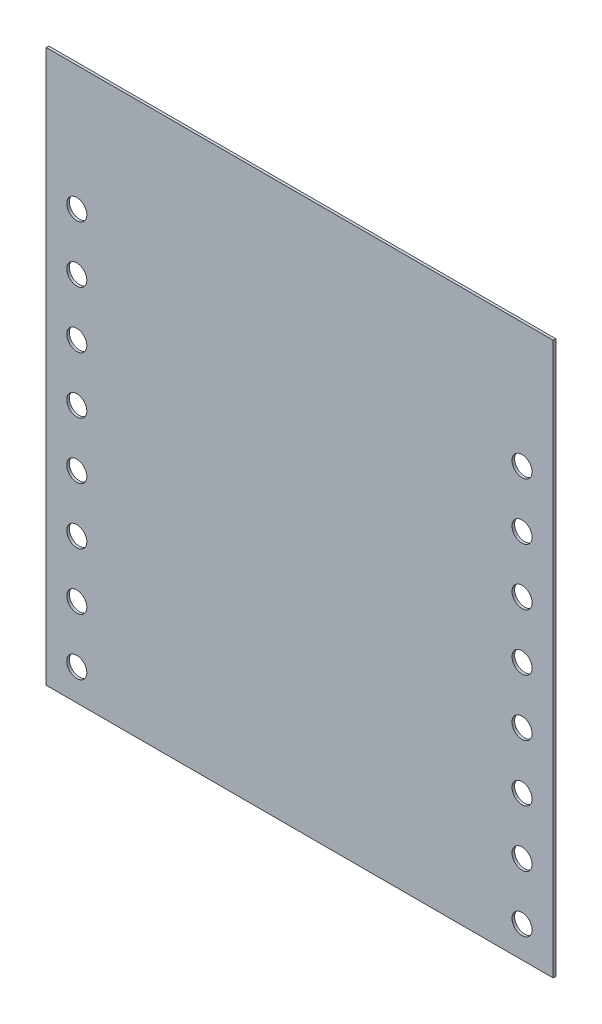
ISO-10303-21;
HEADER;
FILE_DESCRIPTION(('STEP AP214'),'2;1');
FILE_NAME('part.step','',(''),(''),'','','');
FILE_SCHEMA(('AUTOMOTIVE_DESIGN { 1 0 10303 214 1 1 1 1 }'));
ENDSEC;
DATA;
#1=APPLICATION_CONTEXT('core data for automotive mechanical design processes');
#2=APPLICATION_PROTOCOL_DEFINITION('international standard','automotive_design',2000,#1);
#3=PRODUCT_CONTEXT('',#1,'mechanical');
#4=PRODUCT('Part','Part','',(#3));
#5=PRODUCT_RELATED_PRODUCT_CATEGORY('part','',(#4));
#6=PRODUCT_DEFINITION_FORMATION('','',#4);
#7=PRODUCT_DEFINITION_CONTEXT('part definition',#1,'design');
#8=PRODUCT_DEFINITION('design','',#6,#7);
#9=PRODUCT_DEFINITION_SHAPE('','',#8);
#10=(LENGTH_UNIT() NAMED_UNIT(*) SI_UNIT(.MILLI.,.METRE.));
#11=(NAMED_UNIT(*) PLANE_ANGLE_UNIT() SI_UNIT($,.RADIAN.));
#12=(NAMED_UNIT(*) SI_UNIT($,.STERADIAN.) SOLID_ANGLE_UNIT());
#13=UNCERTAINTY_MEASURE_WITH_UNIT(LENGTH_MEASURE(1.E-05),#10,'distance_accuracy_value','');
#14=(GEOMETRIC_REPRESENTATION_CONTEXT(3) GLOBAL_UNCERTAINTY_ASSIGNED_CONTEXT((#13)) GLOBAL_UNIT_ASSIGNED_CONTEXT((#10,
#11,#12)) REPRESENTATION_CONTEXT('',''));
#15=CARTESIAN_POINT('',(0.,0.,0.));
#16=DIRECTION('',(0.,0.,1.));
#17=DIRECTION('',(1.,0.,0.));
#18=AXIS2_PLACEMENT_3D('',#15,#16,#17);
#19=CARTESIAN_POINT('',(0.,0.,0.11684));
#20=DIRECTION('',(0.,0.,-1.));
#21=DIRECTION('',(0.,-1.,0.));
#22=AXIS2_PLACEMENT_3D('',#19,#20,#21);
#23=PLANE('',#22);
#24=CARTESIAN_POINT('',(21.336,14.097,0.11684));
#25=DIRECTION('',(0.,0.,1.));
#26=DIRECTION('',(1.,0.,0.));
#27=AXIS2_PLACEMENT_3D('',#24,#25,#26);
#28=CIRCLE('',#27,0.4499991);
#29=CARTESIAN_POINT('',(21.7859991,14.097,0.11684));
#30=VERTEX_POINT('',#29);
#31=EDGE_CURVE('E26',#30,#30,#28,.T.);
#32=ORIENTED_EDGE('',*,*,#31,.F.);
#33=EDGE_LOOP('',(#32));
#34=FACE_BOUND('',#33,.T.);
#35=CARTESIAN_POINT('',(21.336,11.557,0.11684));
#36=DIRECTION('',(0.,0.,1.));
#37=DIRECTION('',(1.,0.,0.));
#38=AXIS2_PLACEMENT_3D('',#35,#36,#37);
#39=CIRCLE('',#38,0.4499991);
#40=CARTESIAN_POINT('',(21.7859991,11.557,0.11684));
#41=VERTEX_POINT('',#40);
#42=EDGE_CURVE('E354',#41,#41,#39,.T.);
#43=ORIENTED_EDGE('',*,*,#42,.F.);
#44=EDGE_LOOP('',(#43));
#45=FACE_BOUND('',#44,.T.);
#46=CARTESIAN_POINT('',(21.336,19.177,0.11684));
#47=DIRECTION('',(0.,0.,1.));
#48=DIRECTION('',(1.,0.,0.));
#49=AXIS2_PLACEMENT_3D('',#46,#47,#48);
#50=CIRCLE('',#49,0.4499991);
#51=CARTESIAN_POINT('',(21.7859991,19.177,0.11684));
#52=VERTEX_POINT('',#51);
#53=EDGE_CURVE('E252',#52,#52,#50,.T.);
#54=ORIENTED_EDGE('',*,*,#53,.F.);
#55=EDGE_LOOP('',(#54));
#56=FACE_BOUND('',#55,.T.);
#57=CARTESIAN_POINT('',(21.336,16.637,0.11684));
#58=DIRECTION('',(0.,0.,1.));
#59=DIRECTION('',(1.,0.,0.));
#60=AXIS2_PLACEMENT_3D('',#57,#58,#59);
#61=CIRCLE('',#60,0.4499991);
#62=CARTESIAN_POINT('',(21.7859991,16.637,0.11684));
#63=VERTEX_POINT('',#62);
#64=EDGE_CURVE('E392',#63,#63,#61,.T.);
#65=ORIENTED_EDGE('',*,*,#64,.F.);
#66=EDGE_LOOP('',(#65));
#67=FACE_BOUND('',#66,.T.);
#68=CARTESIAN_POINT('',(21.336,3.937,0.11684));
#69=DIRECTION('',(0.,0.,1.));
#70=DIRECTION('',(1.,0.,0.));
#71=AXIS2_PLACEMENT_3D('',#68,#69,#70);
#72=CIRCLE('',#71,0.4499991);
#73=CARTESIAN_POINT('',(21.7859991,3.937,0.11684));
#74=VERTEX_POINT('',#73);
#75=EDGE_CURVE('E382',#74,#74,#72,.T.);
#76=ORIENTED_EDGE('',*,*,#75,.F.);
#77=EDGE_LOOP('',(#76));
#78=FACE_BOUND('',#77,.T.);
#79=CARTESIAN_POINT('',(21.336,1.397,0.11684));
#80=DIRECTION('',(0.,0.,1.));
#81=DIRECTION('',(1.,0.,0.));
#82=AXIS2_PLACEMENT_3D('',#79,#80,#81);
#83=CIRCLE('',#82,0.4499991);
#84=CARTESIAN_POINT('',(21.7859991,1.397,0.11684));
#85=VERTEX_POINT('',#84);
#86=EDGE_CURVE('E347',#85,#85,#83,.T.);
#87=ORIENTED_EDGE('',*,*,#86,.F.);
#88=EDGE_LOOP('',(#87));
#89=FACE_BOUND('',#88,.T.);
#90=CARTESIAN_POINT('',(21.336,9.017,0.11684));
#91=DIRECTION('',(0.,0.,1.));
#92=DIRECTION('',(1.,0.,0.));
#93=AXIS2_PLACEMENT_3D('',#90,#91,#92);
#94=CIRCLE('',#93,0.4499991);
#95=CARTESIAN_POINT('',(21.7859991,9.017,0.11684));
#96=VERTEX_POINT('',#95);
#97=EDGE_CURVE('E321',#96,#96,#94,.T.);
#98=ORIENTED_EDGE('',*,*,#97,.F.);
#99=EDGE_LOOP('',(#98));
#100=FACE_BOUND('',#99,.T.);
#101=CARTESIAN_POINT('',(21.336,6.477,0.11684));
#102=DIRECTION('',(0.,0.,1.));
#103=DIRECTION('',(1.,0.,0.));
#104=AXIS2_PLACEMENT_3D('',#101,#102,#103);
#105=CIRCLE('',#104,0.4499991);
#106=CARTESIAN_POINT('',(21.7859991,6.477,0.11684));
#107=VERTEX_POINT('',#106);
#108=EDGE_CURVE('E364',#107,#107,#105,.T.);
#109=ORIENTED_EDGE('',*,*,#108,.F.);
#110=EDGE_LOOP('',(#109));
#111=FACE_BOUND('',#110,.T.);
#112=CARTESIAN_POINT('',(1.3716,14.097,0.11684));
#113=DIRECTION('',(0.,0.,1.));
#114=DIRECTION('',(1.,0.,0.));
#115=AXIS2_PLACEMENT_3D('',#112,#113,#114);
#116=CIRCLE('',#115,0.4499991);
#117=CARTESIAN_POINT('',(1.8215991,14.097,0.11684));
#118=VERTEX_POINT('',#117);
#119=EDGE_CURVE('E313',#118,#118,#116,.T.);
#120=ORIENTED_EDGE('',*,*,#119,.F.);
#121=EDGE_LOOP('',(#120));
#122=FACE_BOUND('',#121,.T.);
#123=CARTESIAN_POINT('',(1.3716,11.557,0.11684));
#124=DIRECTION('',(0.,0.,1.));
#125=DIRECTION('',(1.,0.,0.));
#126=AXIS2_PLACEMENT_3D('',#123,#124,#125);
#127=CIRCLE('',#126,0.4499991);
#128=CARTESIAN_POINT('',(1.8215991,11.557,0.11684));
#129=VERTEX_POINT('',#128);
#130=EDGE_CURVE('E265',#129,#129,#127,.T.);
#131=ORIENTED_EDGE('',*,*,#130,.F.);
#132=EDGE_LOOP('',(#131));
#133=FACE_BOUND('',#132,.T.);
#134=CARTESIAN_POINT('',(1.3716,19.177,0.11684));
#135=DIRECTION('',(0.,0.,1.));
#136=DIRECTION('',(1.,0.,0.));
#137=AXIS2_PLACEMENT_3D('',#134,#135,#136);
#138=CIRCLE('',#137,0.4499991);
#139=CARTESIAN_POINT('',(1.8215991,19.177,0.11684));
#140=VERTEX_POINT('',#139);
#141=EDGE_CURVE('E296',#140,#140,#138,.T.);
#142=ORIENTED_EDGE('',*,*,#141,.F.);
#143=EDGE_LOOP('',(#142));
#144=FACE_BOUND('',#143,.T.);
#145=CARTESIAN_POINT('',(1.3716,16.637,0.11684));
#146=DIRECTION('',(0.,0.,1.));
#147=DIRECTION('',(1.,0.,0.));
#148=AXIS2_PLACEMENT_3D('',#145,#146,#147);
#149=CIRCLE('',#148,0.4499991);
#150=CARTESIAN_POINT('',(1.8215991,16.637,0.11684));
#151=VERTEX_POINT('',#150);
#152=EDGE_CURVE('E328',#151,#151,#149,.T.);
#153=ORIENTED_EDGE('',*,*,#152,.F.);
#154=EDGE_LOOP('',(#153));
#155=FACE_BOUND('',#154,.T.);
#156=CARTESIAN_POINT('',(1.3716,3.937,0.11684));
#157=DIRECTION('',(0.,0.,1.));
#158=DIRECTION('',(1.,0.,0.));
#159=AXIS2_PLACEMENT_3D('',#156,#157,#158);
#160=CIRCLE('',#159,0.4499991);
#161=CARTESIAN_POINT('',(1.8215991,3.937,0.11684));
#162=VERTEX_POINT('',#161);
#163=EDGE_CURVE('E272',#162,#162,#160,.T.);
#164=ORIENTED_EDGE('',*,*,#163,.F.);
#165=EDGE_LOOP('',(#164));
#166=FACE_BOUND('',#165,.T.);
#167=CARTESIAN_POINT('',(1.3716,1.397,0.11684));
#168=DIRECTION('',(0.,0.,1.));
#169=DIRECTION('',(1.,0.,0.));
#170=AXIS2_PLACEMENT_3D('',#167,#168,#169);
#171=CIRCLE('',#170,0.4499991);
#172=CARTESIAN_POINT('',(1.8215991,1.397,0.11684));
#173=VERTEX_POINT('',#172);
#174=EDGE_CURVE('E303',#173,#173,#171,.T.);
#175=ORIENTED_EDGE('',*,*,#174,.F.);
#176=EDGE_LOOP('',(#175));
#177=FACE_BOUND('',#176,.T.);
#178=CARTESIAN_POINT('',(1.3716,9.017,0.11684));
#179=DIRECTION('',(0.,0.,1.));
#180=DIRECTION('',(1.,0.,0.));
#181=AXIS2_PLACEMENT_3D('',#178,#179,#180);
#182=CIRCLE('',#181,0.4499991);
#183=CARTESIAN_POINT('',(1.8215991,9.017,0.11684));
#184=VERTEX_POINT('',#183);
#185=EDGE_CURVE('E289',#184,#184,#182,.T.);
#186=ORIENTED_EDGE('',*,*,#185,.F.);
#187=EDGE_LOOP('',(#186));
#188=FACE_BOUND('',#187,.T.);
#189=CARTESIAN_POINT('',(1.3716,6.477,0.11684));
#190=DIRECTION('',(0.,0.,1.));
#191=DIRECTION('',(1.,0.,0.));
#192=AXIS2_PLACEMENT_3D('',#189,#190,#191);
#193=CIRCLE('',#192,0.4499991);
#194=CARTESIAN_POINT('',(1.8215991,6.477,0.11684));
#195=VERTEX_POINT('',#194);
#196=EDGE_CURVE('E256',#195,#195,#193,.T.);
#197=ORIENTED_EDGE('',*,*,#196,.F.);
#198=EDGE_LOOP('',(#197));
#199=FACE_BOUND('',#198,.T.);
#200=DIRECTION('',(1.,0.,0.));
#201=VECTOR('',#200,1.);
#202=CARTESIAN_POINT('',(0.,0.,0.11684));
#203=LINE('',#202,#201);
#204=CARTESIAN_POINT('',(0.,0.,0.11684));
#205=VERTEX_POINT('',#204);
#206=CARTESIAN_POINT('',(22.732999801636,0.,0.11684));
#207=VERTEX_POINT('',#206);
#208=EDGE_CURVE('E218',#205,#207,#203,.T.);
#209=ORIENTED_EDGE('',*,*,#208,.T.);
#210=DIRECTION('',(0.,1.,0.));
#211=VECTOR('',#210,1.);
#212=CARTESIAN_POINT('',(22.732999801636,0.,0.11684));
#213=LINE('',#212,#211);
#214=CARTESIAN_POINT('',(22.732999801636,24.764999389648,0.11684));
#215=VERTEX_POINT('',#214);
#216=EDGE_CURVE('E236',#207,#215,#213,.T.);
#217=ORIENTED_EDGE('',*,*,#216,.T.);
#218=DIRECTION('',(-1.,0.,0.));
#219=VECTOR('',#218,1.);
#220=CARTESIAN_POINT('',(22.732999801636,24.764999389648,0.11684));
#221=LINE('',#220,#219);
#222=CARTESIAN_POINT('',(0.,24.764999389648,0.11684));
#223=VERTEX_POINT('',#222);
#224=EDGE_CURVE('E210',#215,#223,#221,.T.);
#225=ORIENTED_EDGE('',*,*,#224,.T.);
#226=DIRECTION('',(0.,-1.,0.));
#227=VECTOR('',#226,1.);
#228=CARTESIAN_POINT('',(0.,24.764999389648,0.11684));
#229=LINE('',#228,#227);
#230=EDGE_CURVE('E209',#223,#205,#229,.T.);
#231=ORIENTED_EDGE('',*,*,#230,.T.);
#232=EDGE_LOOP('',(#209,#217,#225,#231));
#233=FACE_BOUND('',#232,.T.);
#234=ADVANCED_FACE('F17',(#34,#45,#56,#67,#78,#89,#100,#111,#122,#133,#144,#155,#166,#177,#188,
#199,#233),#23,.F.);
#235=CARTESIAN_POINT('',(0.,0.,0.));
#236=DIRECTION('',(0.,0.,-1.));
#237=DIRECTION('',(0.,-1.,0.));
#238=AXIS2_PLACEMENT_3D('',#235,#236,#237);
#239=PLANE('',#238);
#240=CARTESIAN_POINT('',(21.336,14.097,0.));
#241=DIRECTION('',(0.,0.,1.));
#242=DIRECTION('',(1.,0.,0.));
#243=AXIS2_PLACEMENT_3D('',#240,#241,#242);
#244=CIRCLE('',#243,0.4499991);
#245=CARTESIAN_POINT('',(21.7859991,14.097,0.));
#246=VERTEX_POINT('',#245);
#247=EDGE_CURVE('E11',#246,#246,#244,.T.);
#248=ORIENTED_EDGE('',*,*,#247,.T.);
#249=EDGE_LOOP('',(#248));
#250=FACE_BOUND('',#249,.T.);
#251=CARTESIAN_POINT('',(21.336,11.557,0.));
#252=DIRECTION('',(0.,0.,1.));
#253=DIRECTION('',(1.,0.,0.));
#254=AXIS2_PLACEMENT_3D('',#251,#252,#253);
#255=CIRCLE('',#254,0.4499991);
#256=CARTESIAN_POINT('',(21.7859991,11.557,0.));
#257=VERTEX_POINT('',#256);
#258=EDGE_CURVE('E332',#257,#257,#255,.T.);
#259=ORIENTED_EDGE('',*,*,#258,.T.);
#260=EDGE_LOOP('',(#259));
#261=FACE_BOUND('',#260,.T.);
#262=CARTESIAN_POINT('',(21.336,19.177,0.));
#263=DIRECTION('',(0.,0.,1.));
#264=DIRECTION('',(1.,0.,0.));
#265=AXIS2_PLACEMENT_3D('',#262,#263,#264);
#266=CIRCLE('',#265,0.4499991);
#267=CARTESIAN_POINT('',(21.7859991,19.177,0.));
#268=VERTEX_POINT('',#267);
#269=EDGE_CURVE('E248',#268,#268,#266,.T.);
#270=ORIENTED_EDGE('',*,*,#269,.T.);
#271=EDGE_LOOP('',(#270));
#272=FACE_BOUND('',#271,.T.);
#273=CARTESIAN_POINT('',(21.336,16.637,0.));
#274=DIRECTION('',(0.,0.,1.));
#275=DIRECTION('',(1.,0.,0.));
#276=AXIS2_PLACEMENT_3D('',#273,#274,#275);
#277=CIRCLE('',#276,0.4499991);
#278=CARTESIAN_POINT('',(21.7859991,16.637,0.));
#279=VERTEX_POINT('',#278);
#280=EDGE_CURVE('E395',#279,#279,#277,.T.);
#281=ORIENTED_EDGE('',*,*,#280,.T.);
#282=EDGE_LOOP('',(#281));
#283=FACE_BOUND('',#282,.T.);
#284=CARTESIAN_POINT('',(21.336,3.937,0.));
#285=DIRECTION('',(0.,0.,1.));
#286=DIRECTION('',(1.,0.,0.));
#287=AXIS2_PLACEMENT_3D('',#284,#285,#286);
#288=CIRCLE('',#287,0.4499991);
#289=CARTESIAN_POINT('',(21.7859991,3.937,0.));
#290=VERTEX_POINT('',#289);
#291=EDGE_CURVE('E385',#290,#290,#288,.T.);
#292=ORIENTED_EDGE('',*,*,#291,.T.);
#293=EDGE_LOOP('',(#292));
#294=FACE_BOUND('',#293,.T.);
#295=CARTESIAN_POINT('',(21.336,1.397,0.));
#296=DIRECTION('',(0.,0.,1.));
#297=DIRECTION('',(1.,0.,0.));
#298=AXIS2_PLACEMENT_3D('',#295,#296,#297);
#299=CIRCLE('',#298,0.4499991);
#300=CARTESIAN_POINT('',(21.7859991,1.397,0.));
#301=VERTEX_POINT('',#300);
#302=EDGE_CURVE('E375',#301,#301,#299,.T.);
#303=ORIENTED_EDGE('',*,*,#302,.T.);
#304=EDGE_LOOP('',(#303));
#305=FACE_BOUND('',#304,.T.);
#306=CARTESIAN_POINT('',(21.336,9.017,0.));
#307=DIRECTION('',(0.,0.,1.));
#308=DIRECTION('',(1.,0.,0.));
#309=AXIS2_PLACEMENT_3D('',#306,#307,#308);
#310=CIRCLE('',#309,0.4499991);
#311=CARTESIAN_POINT('',(21.7859991,9.017,0.));
#312=VERTEX_POINT('',#311);
#313=EDGE_CURVE('E348',#312,#312,#310,.T.);
#314=ORIENTED_EDGE('',*,*,#313,.T.);
#315=EDGE_LOOP('',(#314));
#316=FACE_BOUND('',#315,.T.);
#317=CARTESIAN_POINT('',(21.336,6.477,0.));
#318=DIRECTION('',(0.,0.,1.));
#319=DIRECTION('',(1.,0.,0.));
#320=AXIS2_PLACEMENT_3D('',#317,#318,#319);
#321=CIRCLE('',#320,0.4499991);
#322=CARTESIAN_POINT('',(21.7859991,6.477,0.));
#323=VERTEX_POINT('',#322);
#324=EDGE_CURVE('E322',#323,#323,#321,.T.);
#325=ORIENTED_EDGE('',*,*,#324,.T.);
#326=EDGE_LOOP('',(#325));
#327=FACE_BOUND('',#326,.T.);
#328=CARTESIAN_POINT('',(1.3716,14.097,0.));
#329=DIRECTION('',(0.,0.,1.));
#330=DIRECTION('',(1.,0.,0.));
#331=AXIS2_PLACEMENT_3D('',#328,#329,#330);
#332=CIRCLE('',#331,0.4499991);
#333=CARTESIAN_POINT('',(1.8215991,14.097,0.));
#334=VERTEX_POINT('',#333);
#335=EDGE_CURVE('E357',#334,#334,#332,.T.);
#336=ORIENTED_EDGE('',*,*,#335,.T.);
#337=EDGE_LOOP('',(#336));
#338=FACE_BOUND('',#337,.T.);
#339=CARTESIAN_POINT('',(1.3716,11.557,0.));
#340=DIRECTION('',(0.,0.,1.));
#341=DIRECTION('',(1.,0.,0.));
#342=AXIS2_PLACEMENT_3D('',#339,#340,#341);
#343=CIRCLE('',#342,0.4499991);
#344=CARTESIAN_POINT('',(1.8215991,11.557,0.));
#345=VERTEX_POINT('',#344);
#346=EDGE_CURVE('E261',#345,#345,#343,.T.);
#347=ORIENTED_EDGE('',*,*,#346,.T.);
#348=EDGE_LOOP('',(#347));
#349=FACE_BOUND('',#348,.T.);
#350=CARTESIAN_POINT('',(1.3716,19.177,0.));
#351=DIRECTION('',(0.,0.,1.));
#352=DIRECTION('',(1.,0.,0.));
#353=AXIS2_PLACEMENT_3D('',#350,#351,#352);
#354=CIRCLE('',#353,0.4499991);
#355=CARTESIAN_POINT('',(1.8215991,19.177,0.));
#356=VERTEX_POINT('',#355);
#357=EDGE_CURVE('E285',#356,#356,#354,.T.);
#358=ORIENTED_EDGE('',*,*,#357,.T.);
#359=EDGE_LOOP('',(#358));
#360=FACE_BOUND('',#359,.T.);
#361=CARTESIAN_POINT('',(1.3716,16.637,0.));
#362=DIRECTION('',(0.,0.,1.));
#363=DIRECTION('',(1.,0.,0.));
#364=AXIS2_PLACEMENT_3D('',#361,#362,#363);
#365=CIRCLE('',#364,0.4499991);
#366=CARTESIAN_POINT('',(1.8215991,16.637,0.));
#367=VERTEX_POINT('',#366);
#368=EDGE_CURVE('E335',#367,#367,#365,.T.);
#369=ORIENTED_EDGE('',*,*,#368,.T.);
#370=EDGE_LOOP('',(#369));
#371=FACE_BOUND('',#370,.T.);
#372=CARTESIAN_POINT('',(1.3716,3.937,0.));
#373=DIRECTION('',(0.,0.,1.));
#374=DIRECTION('',(1.,0.,0.));
#375=AXIS2_PLACEMENT_3D('',#372,#373,#374);
#376=CIRCLE('',#375,0.4499991);
#377=CARTESIAN_POINT('',(1.8215991,3.937,0.));
#378=VERTEX_POINT('',#377);
#379=EDGE_CURVE('E268',#378,#378,#376,.T.);
#380=ORIENTED_EDGE('',*,*,#379,.T.);
#381=EDGE_LOOP('',(#380));
#382=FACE_BOUND('',#381,.T.);
#383=CARTESIAN_POINT('',(1.3716,1.397,0.));
#384=DIRECTION('',(0.,0.,1.));
#385=DIRECTION('',(1.,0.,0.));
#386=AXIS2_PLACEMENT_3D('',#383,#384,#385);
#387=CIRCLE('',#386,0.4499991);
#388=CARTESIAN_POINT('',(1.8215991,1.397,0.));
#389=VERTEX_POINT('',#388);
#390=EDGE_CURVE('E306',#389,#389,#387,.T.);
#391=ORIENTED_EDGE('',*,*,#390,.T.);
#392=EDGE_LOOP('',(#391));
#393=FACE_BOUND('',#392,.T.);
#394=CARTESIAN_POINT('',(1.3716,9.017,0.));
#395=DIRECTION('',(0.,0.,1.));
#396=DIRECTION('',(1.,0.,0.));
#397=AXIS2_PLACEMENT_3D('',#394,#395,#396);
#398=CIRCLE('',#397,0.4499991);
#399=CARTESIAN_POINT('',(1.8215991,9.017,0.));
#400=VERTEX_POINT('',#399);
#401=EDGE_CURVE('E292',#400,#400,#398,.T.);
#402=ORIENTED_EDGE('',*,*,#401,.T.);
#403=EDGE_LOOP('',(#402));
#404=FACE_BOUND('',#403,.T.);
#405=CARTESIAN_POINT('',(1.3716,6.477,0.));
#406=DIRECTION('',(0.,0.,1.));
#407=DIRECTION('',(1.,0.,0.));
#408=AXIS2_PLACEMENT_3D('',#405,#406,#407);
#409=CIRCLE('',#408,0.4499991);
#410=CARTESIAN_POINT('',(1.8215991,6.477,0.));
#411=VERTEX_POINT('',#410);
#412=EDGE_CURVE('E259',#411,#411,#409,.T.);
#413=ORIENTED_EDGE('',*,*,#412,.T.);
#414=EDGE_LOOP('',(#413));
#415=FACE_BOUND('',#414,.T.);
#416=DIRECTION('',(0.,-1.,0.));
#417=VECTOR('',#416,1.);
#418=CARTESIAN_POINT('',(0.,24.764999389648,0.));
#419=LINE('',#418,#417);
#420=CARTESIAN_POINT('',(0.,24.764999389648,0.));
#421=VERTEX_POINT('',#420);
#422=CARTESIAN_POINT('',(0.,0.,0.));
#423=VERTEX_POINT('',#422);
#424=EDGE_CURVE('E198',#421,#423,#419,.T.);
#425=ORIENTED_EDGE('',*,*,#424,.F.);
#426=DIRECTION('',(-1.,0.,0.));
#427=VECTOR('',#426,1.);
#428=CARTESIAN_POINT('',(22.732999801636,24.764999389648,0.));
#429=LINE('',#428,#427);
#430=CARTESIAN_POINT('',(22.732999801636,24.764999389648,0.));
#431=VERTEX_POINT('',#430);
#432=EDGE_CURVE('E233',#431,#421,#429,.T.);
#433=ORIENTED_EDGE('',*,*,#432,.F.);
#434=DIRECTION('',(0.,1.,0.));
#435=VECTOR('',#434,1.);
#436=CARTESIAN_POINT('',(22.732999801636,0.,0.));
#437=LINE('',#436,#435);
#438=CARTESIAN_POINT('',(22.732999801636,0.,0.));
#439=VERTEX_POINT('',#438);
#440=EDGE_CURVE('E220',#439,#431,#437,.T.);
#441=ORIENTED_EDGE('',*,*,#440,.F.);
#442=DIRECTION('',(1.,0.,0.));
#443=VECTOR('',#442,1.);
#444=CARTESIAN_POINT('',(0.,0.,0.));
#445=LINE('',#444,#443);
#446=EDGE_CURVE('E216',#423,#439,#445,.T.);
#447=ORIENTED_EDGE('',*,*,#446,.F.);
#448=EDGE_LOOP('',(#425,#433,#441,#447));
#449=FACE_BOUND('',#448,.T.);
#450=ADVANCED_FACE('F19',(#250,#261,#272,#283,#294,#305,#316,#327,#338,#349,#360,#371,#382,#393,
#404,#415,#449),#239,.T.);
#451=CARTESIAN_POINT('',(21.336,14.097,0.));
#452=DIRECTION('',(0.,0.,-1.));
#453=DIRECTION('',(1.,0.,0.));
#454=AXIS2_PLACEMENT_3D('',#451,#452,#453);
#455=CYLINDRICAL_SURFACE('',#454,0.4499991);
#456=DIRECTION('',(0.,0.,1.));
#457=VECTOR('',#456,1.);
#458=CARTESIAN_POINT('',(21.7859991,14.097,0.));
#459=LINE('',#458,#457);
#460=EDGE_CURVE('E329',#246,#30,#459,.T.);
#461=ORIENTED_EDGE('',*,*,#460,.T.);
#462=ORIENTED_EDGE('',*,*,#31,.T.);
#463=ORIENTED_EDGE('',*,*,#460,.F.);
#464=ORIENTED_EDGE('',*,*,#247,.F.);
#465=EDGE_LOOP('',(#461,#462,#463,#464));
#466=FACE_BOUND('',#465,.T.);
#467=ADVANCED_FACE('F792',(#466),#455,.F.);
#468=CARTESIAN_POINT('',(21.336,11.557,0.));
#469=DIRECTION('',(0.,0.,-1.));
#470=DIRECTION('',(1.,0.,0.));
#471=AXIS2_PLACEMENT_3D('',#468,#469,#470);
#472=CYLINDRICAL_SURFACE('',#471,0.4499991);
#473=DIRECTION('',(0.,0.,1.));
#474=VECTOR('',#473,1.);
#475=CARTESIAN_POINT('',(21.7859991,11.557,0.));
#476=LINE('',#475,#474);
#477=EDGE_CURVE('E251',#257,#41,#476,.T.);
#478=ORIENTED_EDGE('',*,*,#477,.T.);
#479=ORIENTED_EDGE('',*,*,#42,.T.);
#480=ORIENTED_EDGE('',*,*,#477,.F.);
#481=ORIENTED_EDGE('',*,*,#258,.F.);
#482=EDGE_LOOP('',(#478,#479,#480,#481));
#483=FACE_BOUND('',#482,.T.);
#484=ADVANCED_FACE('F781',(#483),#472,.F.);
#485=CARTESIAN_POINT('',(21.336,19.177,0.));
#486=DIRECTION('',(0.,0.,-1.));
#487=DIRECTION('',(1.,0.,0.));
#488=AXIS2_PLACEMENT_3D('',#485,#486,#487);
#489=CYLINDRICAL_SURFACE('',#488,0.4499991);
#490=DIRECTION('',(0.,0.,1.));
#491=VECTOR('',#490,1.);
#492=CARTESIAN_POINT('',(21.7859991,19.177,0.));
#493=LINE('',#492,#491);
#494=EDGE_CURVE('E398',#268,#52,#493,.T.);
#495=ORIENTED_EDGE('',*,*,#494,.T.);
#496=ORIENTED_EDGE('',*,*,#53,.T.);
#497=ORIENTED_EDGE('',*,*,#494,.F.);
#498=ORIENTED_EDGE('',*,*,#269,.F.);
#499=EDGE_LOOP('',(#495,#496,#497,#498));
#500=FACE_BOUND('',#499,.T.);
#501=ADVANCED_FACE('F770',(#500),#489,.F.);
#502=CARTESIAN_POINT('',(21.336,16.637,0.));
#503=DIRECTION('',(0.,0.,-1.));
#504=DIRECTION('',(1.,0.,0.));
#505=AXIS2_PLACEMENT_3D('',#502,#503,#504);
#506=CYLINDRICAL_SURFACE('',#505,0.4499991);
#507=DIRECTION('',(0.,0.,1.));
#508=VECTOR('',#507,1.);
#509=CARTESIAN_POINT('',(21.7859991,16.637,0.));
#510=LINE('',#509,#508);
#511=EDGE_CURVE('E388',#279,#63,#510,.T.);
#512=ORIENTED_EDGE('',*,*,#511,.T.);
#513=ORIENTED_EDGE('',*,*,#64,.T.);
#514=ORIENTED_EDGE('',*,*,#511,.F.);
#515=ORIENTED_EDGE('',*,*,#280,.F.);
#516=EDGE_LOOP('',(#512,#513,#514,#515));
#517=FACE_BOUND('',#516,.T.);
#518=ADVANCED_FACE('F760',(#517),#506,.F.);
#519=CARTESIAN_POINT('',(21.336,3.937,0.));
#520=DIRECTION('',(0.,0.,-1.));
#521=DIRECTION('',(1.,0.,0.));
#522=AXIS2_PLACEMENT_3D('',#519,#520,#521);
#523=CYLINDRICAL_SURFACE('',#522,0.4499991);
#524=DIRECTION('',(0.,0.,1.));
#525=VECTOR('',#524,1.);
#526=CARTESIAN_POINT('',(21.7859991,3.937,0.));
#527=LINE('',#526,#525);
#528=EDGE_CURVE('E378',#290,#74,#527,.T.);
#529=ORIENTED_EDGE('',*,*,#528,.T.);
#530=ORIENTED_EDGE('',*,*,#75,.T.);
#531=ORIENTED_EDGE('',*,*,#528,.F.);
#532=ORIENTED_EDGE('',*,*,#291,.F.);
#533=EDGE_LOOP('',(#529,#530,#531,#532));
#534=FACE_BOUND('',#533,.T.);
#535=ADVANCED_FACE('F749',(#534),#523,.F.);
#536=CARTESIAN_POINT('',(21.336,1.397,0.));
#537=DIRECTION('',(0.,0.,-1.));
#538=DIRECTION('',(1.,0.,0.));
#539=AXIS2_PLACEMENT_3D('',#536,#537,#538);
#540=CYLINDRICAL_SURFACE('',#539,0.4499991);
#541=DIRECTION('',(0.,0.,1.));
#542=VECTOR('',#541,1.);
#543=CARTESIAN_POINT('',(21.7859991,1.397,0.));
#544=LINE('',#543,#542);
#545=EDGE_CURVE('E343',#301,#85,#544,.T.);
#546=ORIENTED_EDGE('',*,*,#545,.T.);
#547=ORIENTED_EDGE('',*,*,#86,.T.);
#548=ORIENTED_EDGE('',*,*,#545,.F.);
#549=ORIENTED_EDGE('',*,*,#302,.F.);
#550=EDGE_LOOP('',(#546,#547,#548,#549));
#551=FACE_BOUND('',#550,.T.);
#552=ADVANCED_FACE('F737',(#551),#540,.F.);
#553=CARTESIAN_POINT('',(21.336,9.017,0.));
#554=DIRECTION('',(0.,0.,-1.));
#555=DIRECTION('',(1.,0.,0.));
#556=AXIS2_PLACEMENT_3D('',#553,#554,#555);
#557=CYLINDRICAL_SURFACE('',#556,0.4499991);
#558=DIRECTION('',(0.,0.,1.));
#559=VECTOR('',#558,1.);
#560=CARTESIAN_POINT('',(21.7859991,9.017,0.));
#561=LINE('',#560,#559);
#562=EDGE_CURVE('E317',#312,#96,#561,.T.);
#563=ORIENTED_EDGE('',*,*,#562,.T.);
#564=ORIENTED_EDGE('',*,*,#97,.T.);
#565=ORIENTED_EDGE('',*,*,#562,.F.);
#566=ORIENTED_EDGE('',*,*,#313,.F.);
#567=EDGE_LOOP('',(#563,#564,#565,#566));
#568=FACE_BOUND('',#567,.T.);
#569=ADVANCED_FACE('F727',(#568),#557,.F.);
#570=CARTESIAN_POINT('',(21.336,6.477,0.));
#571=DIRECTION('',(0.,0.,-1.));
#572=DIRECTION('',(1.,0.,0.));
#573=AXIS2_PLACEMENT_3D('',#570,#571,#572);
#574=CYLINDRICAL_SURFACE('',#573,0.4499991);
#575=DIRECTION('',(0.,0.,1.));
#576=VECTOR('',#575,1.);
#577=CARTESIAN_POINT('',(21.7859991,6.477,0.));
#578=LINE('',#577,#576);
#579=EDGE_CURVE('E360',#323,#107,#578,.T.);
#580=ORIENTED_EDGE('',*,*,#579,.T.);
#581=ORIENTED_EDGE('',*,*,#108,.T.);
#582=ORIENTED_EDGE('',*,*,#579,.F.);
#583=ORIENTED_EDGE('',*,*,#324,.F.);
#584=EDGE_LOOP('',(#580,#581,#582,#583));
#585=FACE_BOUND('',#584,.T.);
#586=ADVANCED_FACE('F717',(#585),#574,.F.);
#587=CARTESIAN_POINT('',(1.3716,14.097,0.));
#588=DIRECTION('',(0.,0.,-1.));
#589=DIRECTION('',(1.,0.,0.));
#590=AXIS2_PLACEMENT_3D('',#587,#588,#589);
#591=CYLINDRICAL_SURFACE('',#590,0.4499991);
#592=DIRECTION('',(0.,0.,1.));
#593=VECTOR('',#592,1.);
#594=CARTESIAN_POINT('',(1.8215991,14.097,0.));
#595=LINE('',#594,#593);
#596=EDGE_CURVE('E264',#334,#118,#595,.T.);
#597=ORIENTED_EDGE('',*,*,#596,.T.);
#598=ORIENTED_EDGE('',*,*,#119,.T.);
#599=ORIENTED_EDGE('',*,*,#596,.F.);
#600=ORIENTED_EDGE('',*,*,#335,.F.);
#601=EDGE_LOOP('',(#597,#598,#599,#600));
#602=FACE_BOUND('',#601,.T.);
#603=ADVANCED_FACE('F706',(#602),#591,.F.);
#604=CARTESIAN_POINT('',(1.3716,11.557,0.));
#605=DIRECTION('',(0.,0.,-1.));
#606=DIRECTION('',(1.,0.,0.));
#607=AXIS2_PLACEMENT_3D('',#604,#605,#606);
#608=CYLINDRICAL_SURFACE('',#607,0.4499991);
#609=DIRECTION('',(0.,0.,1.));
#610=VECTOR('',#609,1.);
#611=CARTESIAN_POINT('',(1.8215991,11.557,0.));
#612=LINE('',#611,#610);
#613=EDGE_CURVE('E281',#345,#129,#612,.T.);
#614=ORIENTED_EDGE('',*,*,#613,.T.);
#615=ORIENTED_EDGE('',*,*,#130,.T.);
#616=ORIENTED_EDGE('',*,*,#613,.F.);
#617=ORIENTED_EDGE('',*,*,#346,.F.);
#618=EDGE_LOOP('',(#614,#615,#616,#617));
#619=FACE_BOUND('',#618,.T.);
#620=ADVANCED_FACE('F695',(#619),#608,.F.);
#621=CARTESIAN_POINT('',(1.3716,19.177,0.));
#622=DIRECTION('',(0.,0.,-1.));
#623=DIRECTION('',(1.,0.,0.));
#624=AXIS2_PLACEMENT_3D('',#621,#622,#623);
#625=CYLINDRICAL_SURFACE('',#624,0.4499991);
#626=DIRECTION('',(0.,0.,1.));
#627=VECTOR('',#626,1.);
#628=CARTESIAN_POINT('',(1.8215991,19.177,0.));
#629=LINE('',#628,#627);
#630=EDGE_CURVE('E299',#356,#140,#629,.T.);
#631=ORIENTED_EDGE('',*,*,#630,.T.);
#632=ORIENTED_EDGE('',*,*,#141,.T.);
#633=ORIENTED_EDGE('',*,*,#630,.F.);
#634=ORIENTED_EDGE('',*,*,#357,.F.);
#635=EDGE_LOOP('',(#631,#632,#633,#634));
#636=FACE_BOUND('',#635,.T.);
#637=ADVANCED_FACE('F684',(#636),#625,.F.);
#638=CARTESIAN_POINT('',(1.3716,16.637,0.));
#639=DIRECTION('',(0.,0.,-1.));
#640=DIRECTION('',(1.,0.,0.));
#641=AXIS2_PLACEMENT_3D('',#638,#639,#640);
#642=CYLINDRICAL_SURFACE('',#641,0.4499991);
#643=DIRECTION('',(0.,0.,1.));
#644=VECTOR('',#643,1.);
#645=CARTESIAN_POINT('',(1.8215991,16.637,0.));
#646=LINE('',#645,#644);
#647=EDGE_CURVE('E271',#367,#151,#646,.T.);
#648=ORIENTED_EDGE('',*,*,#647,.T.);
#649=ORIENTED_EDGE('',*,*,#152,.T.);
#650=ORIENTED_EDGE('',*,*,#647,.F.);
#651=ORIENTED_EDGE('',*,*,#368,.F.);
#652=EDGE_LOOP('',(#648,#649,#650,#651));
#653=FACE_BOUND('',#652,.T.);
#654=ADVANCED_FACE('F674',(#653),#642,.F.);
#655=CARTESIAN_POINT('',(1.3716,3.937,0.));
#656=DIRECTION('',(0.,0.,-1.));
#657=DIRECTION('',(1.,0.,0.));
#658=AXIS2_PLACEMENT_3D('',#655,#656,#657);
#659=CYLINDRICAL_SURFACE('',#658,0.4499991);
#660=DIRECTION('',(0.,0.,1.));
#661=VECTOR('',#660,1.);
#662=CARTESIAN_POINT('',(1.8215991,3.937,0.));
#663=LINE('',#662,#661);
#664=EDGE_CURVE('E309',#378,#162,#663,.T.);
#665=ORIENTED_EDGE('',*,*,#664,.T.);
#666=ORIENTED_EDGE('',*,*,#163,.T.);
#667=ORIENTED_EDGE('',*,*,#664,.F.);
#668=ORIENTED_EDGE('',*,*,#379,.F.);
#669=EDGE_LOOP('',(#665,#666,#667,#668));
#670=FACE_BOUND('',#669,.T.);
#671=ADVANCED_FACE('F663',(#670),#659,.F.);
#672=CARTESIAN_POINT('',(1.3716,1.397,0.));
#673=DIRECTION('',(0.,0.,-1.));
#674=DIRECTION('',(1.,0.,0.));
#675=AXIS2_PLACEMENT_3D('',#672,#673,#674);
#676=CYLINDRICAL_SURFACE('',#675,0.4499991);
#677=DIRECTION('',(0.,0.,1.));
#678=VECTOR('',#677,1.);
#679=CARTESIAN_POINT('',(1.8215991,1.397,0.));
#680=LINE('',#679,#678);
#681=EDGE_CURVE('E295',#389,#173,#680,.T.);
#682=ORIENTED_EDGE('',*,*,#681,.T.);
#683=ORIENTED_EDGE('',*,*,#174,.T.);
#684=ORIENTED_EDGE('',*,*,#681,.F.);
#685=ORIENTED_EDGE('',*,*,#390,.F.);
#686=EDGE_LOOP('',(#682,#683,#684,#685));
#687=FACE_BOUND('',#686,.T.);
#688=ADVANCED_FACE('F652',(#687),#676,.F.);
#689=CARTESIAN_POINT('',(1.3716,9.017,0.));
#690=DIRECTION('',(0.,0.,-1.));
#691=DIRECTION('',(1.,0.,0.));
#692=AXIS2_PLACEMENT_3D('',#689,#690,#691);
#693=CYLINDRICAL_SURFACE('',#692,0.4499991);
#694=DIRECTION('',(0.,0.,1.));
#695=VECTOR('',#694,1.);
#696=CARTESIAN_POINT('',(1.8215991,9.017,0.));
#697=LINE('',#696,#695);
#698=EDGE_CURVE('E280',#400,#184,#697,.T.);
#699=ORIENTED_EDGE('',*,*,#698,.T.);
#700=ORIENTED_EDGE('',*,*,#185,.T.);
#701=ORIENTED_EDGE('',*,*,#698,.F.);
#702=ORIENTED_EDGE('',*,*,#401,.F.);
#703=EDGE_LOOP('',(#699,#700,#701,#702));
#704=FACE_BOUND('',#703,.T.);
#705=ADVANCED_FACE('F642',(#704),#693,.F.);
#706=CARTESIAN_POINT('',(1.3716,6.477,0.));
#707=DIRECTION('',(0.,0.,-1.));
#708=DIRECTION('',(1.,0.,0.));
#709=AXIS2_PLACEMENT_3D('',#706,#707,#708);
#710=CYLINDRICAL_SURFACE('',#709,0.4499991);
#711=DIRECTION('',(0.,0.,1.));
#712=VECTOR('',#711,1.);
#713=CARTESIAN_POINT('',(1.8215991,6.477,0.));
#714=LINE('',#713,#712);
#715=EDGE_CURVE('E260',#411,#195,#714,.T.);
#716=ORIENTED_EDGE('',*,*,#715,.T.);
#717=ORIENTED_EDGE('',*,*,#196,.T.);
#718=ORIENTED_EDGE('',*,*,#715,.F.);
#719=ORIENTED_EDGE('',*,*,#412,.F.);
#720=EDGE_LOOP('',(#716,#717,#718,#719));
#721=FACE_BOUND('',#720,.T.);
#722=ADVANCED_FACE('F631',(#721),#710,.F.);
#723=CARTESIAN_POINT('',(0.,24.764999389648,0.));
#724=DIRECTION('',(1.,0.,0.));
#725=DIRECTION('',(0.,1.,0.));
#726=AXIS2_PLACEMENT_3D('',#723,#724,#725);
#727=PLANE('',#726);
#728=ORIENTED_EDGE('',*,*,#424,.T.);
#729=DIRECTION('',(0.,0.,1.));
#730=VECTOR('',#729,1.);
#731=CARTESIAN_POINT('',(0.,0.,0.));
#732=LINE('',#731,#730);
#733=EDGE_CURVE('E201',#423,#205,#732,.T.);
#734=ORIENTED_EDGE('',*,*,#733,.T.);
#735=ORIENTED_EDGE('',*,*,#230,.F.);
#736=DIRECTION('',(0.,0.,1.));
#737=VECTOR('',#736,1.);
#738=CARTESIAN_POINT('',(0.,24.764999389648,0.));
#739=LINE('',#738,#737);
#740=EDGE_CURVE('E204',#421,#223,#739,.T.);
#741=ORIENTED_EDGE('',*,*,#740,.F.);
#742=EDGE_LOOP('',(#728,#734,#735,#741));
#743=FACE_BOUND('',#742,.T.);
#744=ADVANCED_FACE('F200',(#743),#727,.F.);
#745=CARTESIAN_POINT('',(22.732999801636,24.764999389648,0.));
#746=DIRECTION('',(0.,-1.,0.));
#747=DIRECTION('',(0.,0.,-1.));
#748=AXIS2_PLACEMENT_3D('',#745,#746,#747);
#749=PLANE('',#748);
#750=ORIENTED_EDGE('',*,*,#432,.T.);
#751=ORIENTED_EDGE('',*,*,#740,.T.);
#752=ORIENTED_EDGE('',*,*,#224,.F.);
#753=DIRECTION('',(0.,0.,1.));
#754=VECTOR('',#753,1.);
#755=CARTESIAN_POINT('',(22.732999801636,24.764999389648,0.));
#756=LINE('',#755,#754);
#757=EDGE_CURVE('E240',#431,#215,#756,.T.);
#758=ORIENTED_EDGE('',*,*,#757,.F.);
#759=EDGE_LOOP('',(#750,#751,#752,#758));
#760=FACE_BOUND('',#759,.T.);
#761=ADVANCED_FACE('F607',(#760),#749,.F.);
#762=CARTESIAN_POINT('',(22.732999801636,0.,0.));
#763=DIRECTION('',(-1.,0.,0.));
#764=DIRECTION('',(0.,0.,1.));
#765=AXIS2_PLACEMENT_3D('',#762,#763,#764);
#766=PLANE('',#765);
#767=ORIENTED_EDGE('',*,*,#440,.T.);
#768=ORIENTED_EDGE('',*,*,#757,.T.);
#769=ORIENTED_EDGE('',*,*,#216,.F.);
#770=DIRECTION('',(0.,0.,1.));
#771=VECTOR('',#770,1.);
#772=CARTESIAN_POINT('',(22.732999801636,0.,0.));
#773=LINE('',#772,#771);
#774=EDGE_CURVE('E225',#439,#207,#773,.T.);
#775=ORIENTED_EDGE('',*,*,#774,.F.);
#776=EDGE_LOOP('',(#767,#768,#769,#775));
#777=FACE_BOUND('',#776,.T.);
#778=ADVANCED_FACE('F595',(#777),#766,.F.);
#779=CARTESIAN_POINT('',(0.,0.,0.));
#780=DIRECTION('',(0.,1.,0.));
#781=DIRECTION('',(1.,0.,0.));
#782=AXIS2_PLACEMENT_3D('',#779,#780,#781);
#783=PLANE('',#782);
#784=ORIENTED_EDGE('',*,*,#446,.T.);
#785=ORIENTED_EDGE('',*,*,#774,.T.);
#786=ORIENTED_EDGE('',*,*,#208,.F.);
#787=ORIENTED_EDGE('',*,*,#733,.F.);
#788=EDGE_LOOP('',(#784,#785,#786,#787));
#789=FACE_BOUND('',#788,.T.);
#790=ADVANCED_FACE('F214',(#789),#783,.F.);
#791=CLOSED_SHELL('',(#234,#450,#467,#484,#501,#518,#535,#552,#569,#586,#603,#620,#637,#654,
#671,#688,#705,#722,#744,#761,#778,#790));
#792=MANIFOLD_SOLID_BREP('B1',#791);
#793=ADVANCED_BREP_SHAPE_REPRESENTATION('',(#18,#792),#14);
#794=SHAPE_DEFINITION_REPRESENTATION(#9,#793);
ENDSEC;
END-ISO-10303-21;
